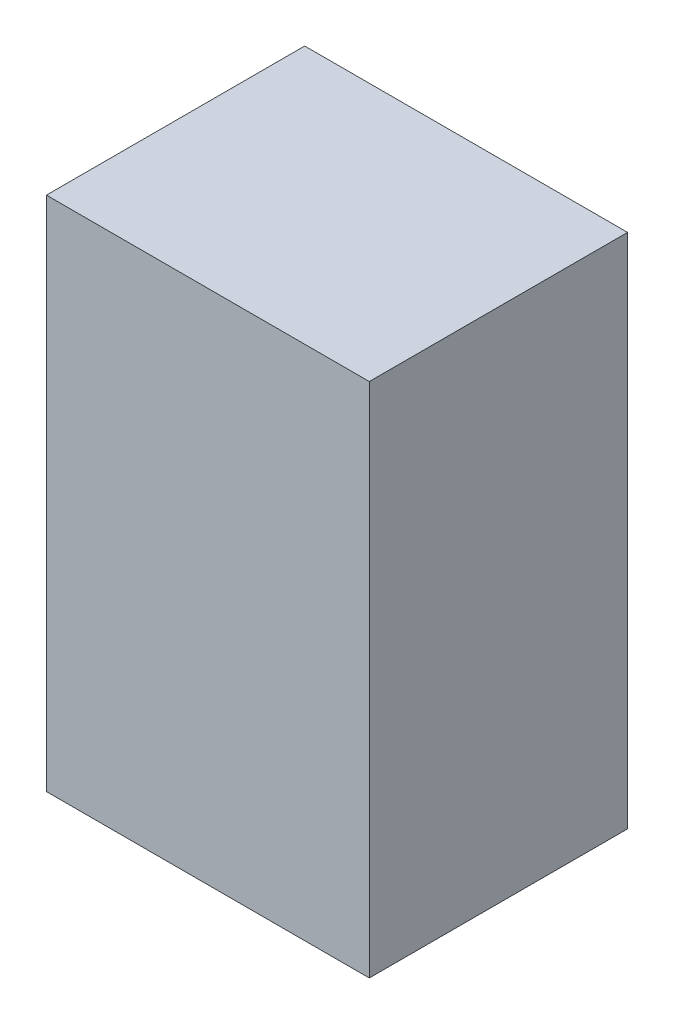
ISO-10303-21;
HEADER;
FILE_DESCRIPTION(('STEP AP214'),'2;1');
FILE_NAME('part.step','',(''),(''),'','','');
FILE_SCHEMA(('AUTOMOTIVE_DESIGN { 1 0 10303 214 1 1 1 1 }'));
ENDSEC;
DATA;
#1=APPLICATION_CONTEXT('core data for automotive mechanical design processes');
#2=APPLICATION_PROTOCOL_DEFINITION('international standard','automotive_design',2000,#1);
#3=PRODUCT_CONTEXT('',#1,'mechanical');
#4=PRODUCT('Part','Part','',(#3));
#5=PRODUCT_RELATED_PRODUCT_CATEGORY('part','',(#4));
#6=PRODUCT_DEFINITION_FORMATION('','',#4);
#7=PRODUCT_DEFINITION_CONTEXT('part definition',#1,'design');
#8=PRODUCT_DEFINITION('design','',#6,#7);
#9=PRODUCT_DEFINITION_SHAPE('','',#8);
#10=(LENGTH_UNIT() NAMED_UNIT(*) SI_UNIT(.MILLI.,.METRE.));
#11=(NAMED_UNIT(*) PLANE_ANGLE_UNIT() SI_UNIT($,.RADIAN.));
#12=(NAMED_UNIT(*) SI_UNIT($,.STERADIAN.) SOLID_ANGLE_UNIT());
#13=UNCERTAINTY_MEASURE_WITH_UNIT(LENGTH_MEASURE(1.E-05),#10,'distance_accuracy_value','');
#14=(GEOMETRIC_REPRESENTATION_CONTEXT(3) GLOBAL_UNCERTAINTY_ASSIGNED_CONTEXT((#13)) GLOBAL_UNIT_ASSIGNED_CONTEXT((#10,
#11,#12)) REPRESENTATION_CONTEXT('',''));
#15=CARTESIAN_POINT('',(0.,0.,0.));
#16=DIRECTION('',(0.,0.,1.));
#17=DIRECTION('',(1.,0.,0.));
#18=AXIS2_PLACEMENT_3D('',#15,#16,#17);
#19=CARTESIAN_POINT('',(0.62500002,-1.00000054,0.));
#20=DIRECTION('',(-1.,0.,0.));
#21=DIRECTION('',(0.,1.,0.));
#22=AXIS2_PLACEMENT_3D('',#19,#20,#21);
#23=PLANE('',#22);
#24=DIRECTION('',(0.,1.,0.));
#25=VECTOR('',#24,1.);
#26=CARTESIAN_POINT('',(0.62500002,-1.00000054,0.));
#27=LINE('',#26,#25);
#28=CARTESIAN_POINT('',(0.62500002,-1.00000054,0.));
#29=VERTEX_POINT('',#28);
#30=CARTESIAN_POINT('',(0.62500002,0.999998,0.));
#31=VERTEX_POINT('',#30);
#32=EDGE_CURVE('E10',#29,#31,#27,.T.);
#33=ORIENTED_EDGE('',*,*,#32,.T.);
#34=DIRECTION('',(0.,0.,1.));
#35=VECTOR('',#34,1.);
#36=CARTESIAN_POINT('',(0.62500002,0.999998,0.));
#37=LINE('',#36,#35);
#38=CARTESIAN_POINT('',(0.62500002,0.999998,1.00000054));
#39=VERTEX_POINT('',#38);
#40=EDGE_CURVE('E23',#31,#39,#37,.T.);
#41=ORIENTED_EDGE('',*,*,#40,.T.);
#42=DIRECTION('',(0.,1.,0.));
#43=VECTOR('',#42,1.);
#44=CARTESIAN_POINT('',(0.62500002,-1.00000054,1.00000054));
#45=LINE('',#44,#43);
#46=CARTESIAN_POINT('',(0.62500002,-1.00000054,1.00000054));
#47=VERTEX_POINT('',#46);
#48=EDGE_CURVE('E86',#47,#39,#45,.T.);
#49=ORIENTED_EDGE('',*,*,#48,.F.);
#50=DIRECTION('',(0.,0.,1.));
#51=VECTOR('',#50,1.);
#52=CARTESIAN_POINT('',(0.62500002,-1.00000054,0.));
#53=LINE('',#52,#51);
#54=EDGE_CURVE('E37',#29,#47,#53,.T.);
#55=ORIENTED_EDGE('',*,*,#54,.F.);
#56=EDGE_LOOP('',(#33,#41,#49,#55));
#57=FACE_BOUND('',#56,.T.);
#58=ADVANCED_FACE('F16',(#57),#23,.F.);
#59=CARTESIAN_POINT('',(0.62500002,0.999998,0.));
#60=DIRECTION('',(0.,-1.,0.));
#61=DIRECTION('',(-1.,0.,0.));
#62=AXIS2_PLACEMENT_3D('',#59,#60,#61);
#63=PLANE('',#62);
#64=DIRECTION('',(-1.,0.,0.));
#65=VECTOR('',#64,1.);
#66=CARTESIAN_POINT('',(0.62500002,0.999998,0.));
#67=LINE('',#66,#65);
#68=CARTESIAN_POINT('',(-0.62500002,0.999998,0.));
#69=VERTEX_POINT('',#68);
#70=EDGE_CURVE('E30',#31,#69,#67,.T.);
#71=ORIENTED_EDGE('',*,*,#70,.T.);
#72=DIRECTION('',(0.,0.,1.));
#73=VECTOR('',#72,1.);
#74=CARTESIAN_POINT('',(-0.62500002,0.999998,0.));
#75=LINE('',#74,#73);
#76=CARTESIAN_POINT('',(-0.62500002,0.999998,1.00000054));
#77=VERTEX_POINT('',#76);
#78=EDGE_CURVE('E82',#69,#77,#75,.T.);
#79=ORIENTED_EDGE('',*,*,#78,.T.);
#80=DIRECTION('',(-1.,0.,0.));
#81=VECTOR('',#80,1.);
#82=CARTESIAN_POINT('',(0.62500002,0.999998,1.00000054));
#83=LINE('',#82,#81);
#84=EDGE_CURVE('E62',#39,#77,#83,.T.);
#85=ORIENTED_EDGE('',*,*,#84,.F.);
#86=ORIENTED_EDGE('',*,*,#40,.F.);
#87=EDGE_LOOP('',(#71,#79,#85,#86));
#88=FACE_BOUND('',#87,.T.);
#89=ADVANCED_FACE('F89',(#88),#63,.F.);
#90=CARTESIAN_POINT('',(-0.62500002,0.999998,0.));
#91=DIRECTION('',(1.,0.,0.));
#92=DIRECTION('',(0.,-1.,0.));
#93=AXIS2_PLACEMENT_3D('',#90,#91,#92);
#94=PLANE('',#93);
#95=DIRECTION('',(0.,-1.,0.));
#96=VECTOR('',#95,1.);
#97=CARTESIAN_POINT('',(-0.62500002,0.999998,0.));
#98=LINE('',#97,#96);
#99=CARTESIAN_POINT('',(-0.62500002,-1.00000054,0.));
#100=VERTEX_POINT('',#99);
#101=EDGE_CURVE('E71',#69,#100,#98,.T.);
#102=ORIENTED_EDGE('',*,*,#101,.T.);
#103=DIRECTION('',(0.,0.,1.));
#104=VECTOR('',#103,1.);
#105=CARTESIAN_POINT('',(-0.62500002,-1.00000054,0.));
#106=LINE('',#105,#104);
#107=CARTESIAN_POINT('',(-0.62500002,-1.00000054,1.00000054));
#108=VERTEX_POINT('',#107);
#109=EDGE_CURVE('E66',#100,#108,#106,.T.);
#110=ORIENTED_EDGE('',*,*,#109,.T.);
#111=DIRECTION('',(0.,-1.,0.));
#112=VECTOR('',#111,1.);
#113=CARTESIAN_POINT('',(-0.62500002,0.999998,1.00000054));
#114=LINE('',#113,#112);
#115=EDGE_CURVE('E56',#77,#108,#114,.T.);
#116=ORIENTED_EDGE('',*,*,#115,.F.);
#117=ORIENTED_EDGE('',*,*,#78,.F.);
#118=EDGE_LOOP('',(#102,#110,#116,#117));
#119=FACE_BOUND('',#118,.T.);
#120=ADVANCED_FACE('F70',(#119),#94,.F.);
#121=CARTESIAN_POINT('',(-0.62500002,-1.00000054,0.));
#122=DIRECTION('',(0.,1.,0.));
#123=DIRECTION('',(1.,0.,0.));
#124=AXIS2_PLACEMENT_3D('',#121,#122,#123);
#125=PLANE('',#124);
#126=DIRECTION('',(1.,0.,0.));
#127=VECTOR('',#126,1.);
#128=CARTESIAN_POINT('',(-0.62500002,-1.00000054,0.));
#129=LINE('',#128,#127);
#130=EDGE_CURVE('E67',#100,#29,#129,.T.);
#131=ORIENTED_EDGE('',*,*,#130,.T.);
#132=ORIENTED_EDGE('',*,*,#54,.T.);
#133=DIRECTION('',(1.,0.,0.));
#134=VECTOR('',#133,1.);
#135=CARTESIAN_POINT('',(-0.62500002,-1.00000054,1.00000054));
#136=LINE('',#135,#134);
#137=EDGE_CURVE('E60',#108,#47,#136,.T.);
#138=ORIENTED_EDGE('',*,*,#137,.F.);
#139=ORIENTED_EDGE('',*,*,#109,.F.);
#140=EDGE_LOOP('',(#131,#132,#138,#139));
#141=FACE_BOUND('',#140,.T.);
#142=ADVANCED_FACE('F76',(#141),#125,.F.);
#143=CARTESIAN_POINT('',(0.,-1.26999999845E-06,0.));
#144=DIRECTION('',(0.,0.,1.));
#145=DIRECTION('',(-1.,0.,0.));
#146=AXIS2_PLACEMENT_3D('',#143,#144,#145);
#147=PLANE('',#146);
#148=ORIENTED_EDGE('',*,*,#130,.F.);
#149=ORIENTED_EDGE('',*,*,#101,.F.);
#150=ORIENTED_EDGE('',*,*,#70,.F.);
#151=ORIENTED_EDGE('',*,*,#32,.F.);
#152=EDGE_LOOP('',(#148,#149,#150,#151));
#153=FACE_BOUND('',#152,.T.);
#154=ADVANCED_FACE('F90',(#153),#147,.F.);
#155=CARTESIAN_POINT('',(0.,-1.26999999845E-06,1.00000054));
#156=DIRECTION('',(0.,0.,1.));
#157=DIRECTION('',(-1.,0.,0.));
#158=AXIS2_PLACEMENT_3D('',#155,#156,#157);
#159=PLANE('',#158);
#160=ORIENTED_EDGE('',*,*,#48,.T.);
#161=ORIENTED_EDGE('',*,*,#84,.T.);
#162=ORIENTED_EDGE('',*,*,#115,.T.);
#163=ORIENTED_EDGE('',*,*,#137,.T.);
#164=EDGE_LOOP('',(#160,#161,#162,#163));
#165=FACE_BOUND('',#164,.T.);
#166=ADVANCED_FACE('F58',(#165),#159,.T.);
#167=CLOSED_SHELL('',(#58,#89,#120,#142,#154,#166));
#168=MANIFOLD_SOLID_BREP('B1',#167);
#169=ADVANCED_BREP_SHAPE_REPRESENTATION('',(#18,#168),#14);
#170=SHAPE_DEFINITION_REPRESENTATION(#9,#169);
ENDSEC;
END-ISO-10303-21;
